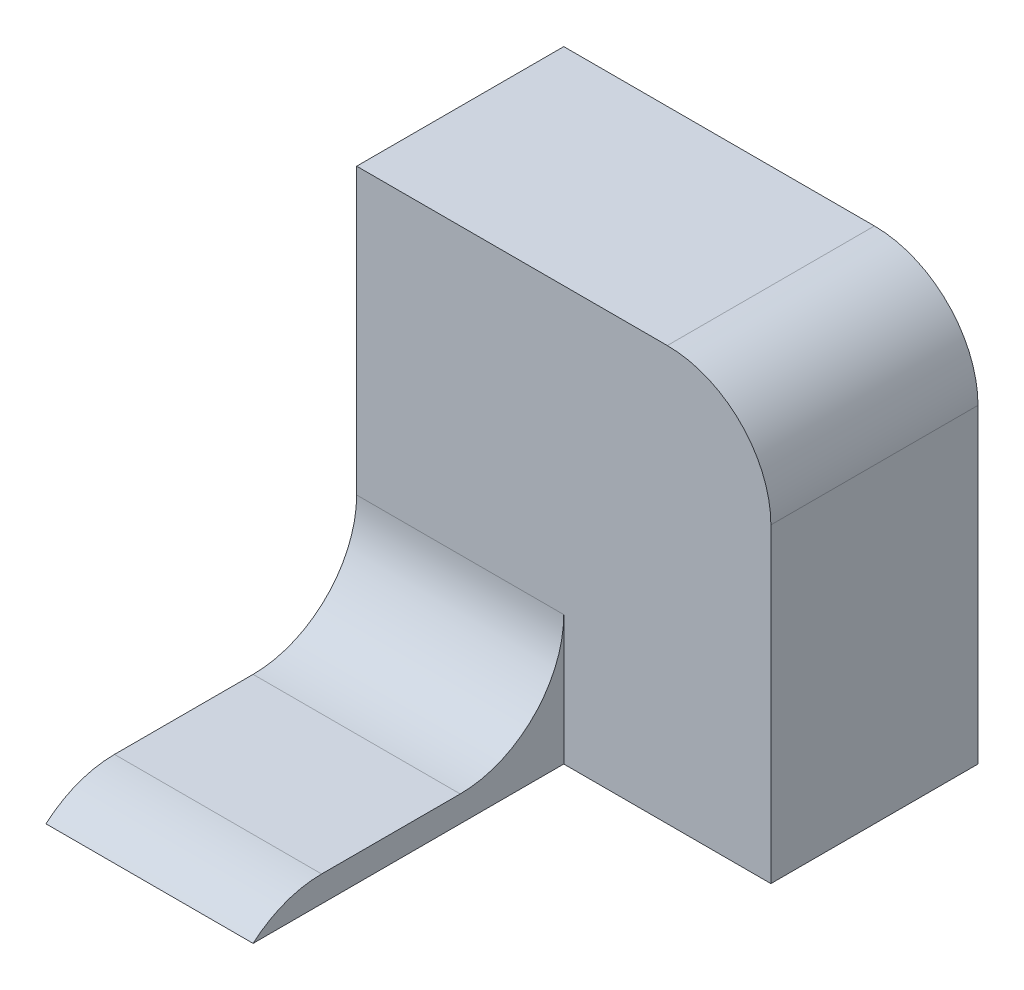
ISO-10303-21;
HEADER;
FILE_DESCRIPTION(('STEP AP214'),'2;1');
FILE_NAME('part.step','',(''),(''),'','','');
FILE_SCHEMA(('AUTOMOTIVE_DESIGN { 1 0 10303 214 1 1 1 1 }'));
ENDSEC;
DATA;
#1=APPLICATION_CONTEXT('core data for automotive mechanical design processes');
#2=APPLICATION_PROTOCOL_DEFINITION('international standard','automotive_design',2000,#1);
#3=PRODUCT_CONTEXT('',#1,'mechanical');
#4=PRODUCT('Part','Part','',(#3));
#5=PRODUCT_RELATED_PRODUCT_CATEGORY('part','',(#4));
#6=PRODUCT_DEFINITION_FORMATION('','',#4);
#7=PRODUCT_DEFINITION_CONTEXT('part definition',#1,'design');
#8=PRODUCT_DEFINITION('design','',#6,#7);
#9=PRODUCT_DEFINITION_SHAPE('','',#8);
#10=(LENGTH_UNIT() NAMED_UNIT(*) SI_UNIT(.MILLI.,.METRE.));
#11=(NAMED_UNIT(*) PLANE_ANGLE_UNIT() SI_UNIT($,.RADIAN.));
#12=(NAMED_UNIT(*) SI_UNIT($,.STERADIAN.) SOLID_ANGLE_UNIT());
#13=UNCERTAINTY_MEASURE_WITH_UNIT(LENGTH_MEASURE(1.E-05),#10,'distance_accuracy_value','');
#14=(GEOMETRIC_REPRESENTATION_CONTEXT(3) GLOBAL_UNCERTAINTY_ASSIGNED_CONTEXT((#13)) GLOBAL_UNIT_ASSIGNED_CONTEXT((#10,
#11,#12)) REPRESENTATION_CONTEXT('',''));
#15=CARTESIAN_POINT('',(0.,0.,0.));
#16=DIRECTION('',(0.,0.,1.));
#17=DIRECTION('',(1.,0.,0.));
#18=AXIS2_PLACEMENT_3D('',#15,#16,#17);
#19=CARTESIAN_POINT('',(-10.,0.,30.));
#20=DIRECTION('',(0.,-1.,0.));
#21=DIRECTION('',(1.,0.,0.));
#22=AXIS2_PLACEMENT_3D('',#19,#20,#21);
#23=PLANE('',#22);
#24=DIRECTION('',(0.,0.,-1.));
#25=VECTOR('',#24,1.);
#26=CARTESIAN_POINT('',(-10.,0.,30.));
#27=LINE('',#26,#25);
#28=CARTESIAN_POINT('',(-10.,0.,23.3856217223385));
#29=VERTEX_POINT('',#28);
#30=CARTESIAN_POINT('',(-10.,0.,10.));
#31=VERTEX_POINT('',#30);
#32=EDGE_CURVE('E144',#29,#31,#27,.T.);
#33=ORIENTED_EDGE('',*,*,#32,.T.);
#34=DIRECTION('',(-1.,0.,0.));
#35=VECTOR('',#34,1.);
#36=CARTESIAN_POINT('',(-10.,0.,10.));
#37=LINE('',#36,#35);
#38=CARTESIAN_POINT('',(-30.,0.,10.));
#39=VERTEX_POINT('',#38);
#40=EDGE_CURVE('E158',#31,#39,#37,.T.);
#41=ORIENTED_EDGE('',*,*,#40,.T.);
#42=DIRECTION('',(0.,0.,-1.));
#43=VECTOR('',#42,1.);
#44=CARTESIAN_POINT('',(-30.,0.,30.));
#45=LINE('',#44,#43);
#46=CARTESIAN_POINT('',(-30.,0.,23.3856217223385));
#47=VERTEX_POINT('',#46);
#48=EDGE_CURVE('E153',#47,#39,#45,.T.);
#49=ORIENTED_EDGE('',*,*,#48,.F.);
#50=DIRECTION('',(-1.,0.,0.));
#51=VECTOR('',#50,1.);
#52=CARTESIAN_POINT('',(-10.,0.,23.3856217223385));
#53=LINE('',#52,#51);
#54=EDGE_CURVE('E156',#47,#29,#53,.F.);
#55=ORIENTED_EDGE('',*,*,#54,.T.);
#56=EDGE_LOOP('',(#33,#41,#49,#55));
#57=FACE_BOUND('',#56,.T.);
#58=ADVANCED_FACE('F35',(#57),#23,.F.);
#59=CARTESIAN_POINT('',(-30.,0.,30.));
#60=DIRECTION('',(1.,0.,0.));
#61=DIRECTION('',(0.,0.,-1.));
#62=AXIS2_PLACEMENT_3D('',#59,#60,#61);
#63=PLANE('',#62);
#64=DIRECTION('',(0.,0.,-1.));
#65=VECTOR('',#64,1.);
#66=CARTESIAN_POINT('',(-30.,-2.5,30.));
#67=LINE('',#66,#65);
#68=CARTESIAN_POINT('',(-30.,-2.5,30.));
#69=VERTEX_POINT('',#68);
#70=CARTESIAN_POINT('',(-30.,-2.5,-20.));
#71=VERTEX_POINT('',#70);
#72=EDGE_CURVE('E151',#69,#71,#67,.T.);
#73=ORIENTED_EDGE('',*,*,#72,.F.);
#74=CARTESIAN_POINT('',(-30.,-10.,23.3856217223385));
#75=DIRECTION('',(1.,0.,0.));
#76=DIRECTION('',(0.,0.,-1.));
#77=AXIS2_PLACEMENT_3D('',#74,#75,#76);
#78=CIRCLE('',#77,10.);
#79=EDGE_CURVE('E171',#69,#47,#78,.F.);
#80=ORIENTED_EDGE('',*,*,#79,.T.);
#81=ORIENTED_EDGE('',*,*,#48,.T.);
#82=CARTESIAN_POINT('',(-30.,10.,10.));
#83=DIRECTION('',(1.,0.,0.));
#84=DIRECTION('',(0.,0.,-1.));
#85=AXIS2_PLACEMENT_3D('',#82,#83,#84);
#86=CIRCLE('',#85,10.);
#87=CARTESIAN_POINT('',(-30.,10.,0.));
#88=VERTEX_POINT('',#87);
#89=EDGE_CURVE('E43',#39,#88,#86,.T.);
#90=ORIENTED_EDGE('',*,*,#89,.T.);
#91=DIRECTION('',(0.,-1.,0.));
#92=VECTOR('',#91,1.);
#93=CARTESIAN_POINT('',(-30.,37.5,0.));
#94=LINE('',#93,#92);
#95=CARTESIAN_POINT('',(-30.,37.5,0.));
#96=VERTEX_POINT('',#95);
#97=EDGE_CURVE('E119',#96,#88,#94,.T.);
#98=ORIENTED_EDGE('',*,*,#97,.F.);
#99=DIRECTION('',(0.,0.,1.));
#100=VECTOR('',#99,1.);
#101=CARTESIAN_POINT('',(-30.,37.5,-20.));
#102=LINE('',#101,#100);
#103=CARTESIAN_POINT('',(-30.,37.5,-20.));
#104=VERTEX_POINT('',#103);
#105=EDGE_CURVE('E108',#104,#96,#102,.T.);
#106=ORIENTED_EDGE('',*,*,#105,.F.);
#107=DIRECTION('',(0.,-1.,0.));
#108=VECTOR('',#107,1.);
#109=CARTESIAN_POINT('',(-30.,37.5,-20.));
#110=LINE('',#109,#108);
#111=EDGE_CURVE('E111',#104,#71,#110,.T.);
#112=ORIENTED_EDGE('',*,*,#111,.T.);
#113=EDGE_LOOP('',(#73,#80,#81,#90,#98,#106,#112));
#114=FACE_BOUND('',#113,.T.);
#115=ADVANCED_FACE('F117',(#114),#63,.F.);
#116=CARTESIAN_POINT('',(-30.,-2.5,30.));
#117=DIRECTION('',(0.,1.,0.));
#118=DIRECTION('',(0.,0.,1.));
#119=AXIS2_PLACEMENT_3D('',#116,#117,#118);
#120=PLANE('',#119);
#121=ORIENTED_EDGE('',*,*,#72,.T.);
#122=DIRECTION('',(1.,0.,0.));
#123=VECTOR('',#122,1.);
#124=CARTESIAN_POINT('',(-30.,-2.5,-20.));
#125=LINE('',#124,#123);
#126=CARTESIAN_POINT('',(10.,-2.5,-20.));
#127=VERTEX_POINT('',#126);
#128=EDGE_CURVE('E126',#71,#127,#125,.T.);
#129=ORIENTED_EDGE('',*,*,#128,.T.);
#130=DIRECTION('',(0.,0.,1.));
#131=VECTOR('',#130,1.);
#132=CARTESIAN_POINT('',(10.,-2.5,-20.));
#133=LINE('',#132,#131);
#134=CARTESIAN_POINT('',(10.,-2.5,0.));
#135=VERTEX_POINT('',#134);
#136=EDGE_CURVE('E120',#127,#135,#133,.T.);
#137=ORIENTED_EDGE('',*,*,#136,.T.);
#138=DIRECTION('',(1.,0.,0.));
#139=VECTOR('',#138,1.);
#140=CARTESIAN_POINT('',(-30.,-2.5,0.));
#141=LINE('',#140,#139);
#142=CARTESIAN_POINT('',(-10.,-2.5,0.));
#143=VERTEX_POINT('',#142);
#144=EDGE_CURVE('E134',#143,#135,#141,.T.);
#145=ORIENTED_EDGE('',*,*,#144,.F.);
#146=DIRECTION('',(0.,0.,-1.));
#147=VECTOR('',#146,1.);
#148=CARTESIAN_POINT('',(-10.,-2.5,30.));
#149=LINE('',#148,#147);
#150=CARTESIAN_POINT('',(-10.,-2.5,30.));
#151=VERTEX_POINT('',#150);
#152=EDGE_CURVE('E148',#151,#143,#149,.T.);
#153=ORIENTED_EDGE('',*,*,#152,.F.);
#154=DIRECTION('',(1.,0.,0.));
#155=VECTOR('',#154,1.);
#156=CARTESIAN_POINT('',(-30.,-2.5,30.));
#157=LINE('',#156,#155);
#158=EDGE_CURVE('E141',#69,#151,#157,.T.);
#159=ORIENTED_EDGE('',*,*,#158,.F.);
#160=EDGE_LOOP('',(#121,#129,#137,#145,#153,#159));
#161=FACE_BOUND('',#160,.T.);
#162=ADVANCED_FACE('F193',(#161),#120,.F.);
#163=CARTESIAN_POINT('',(-10.,-2.5,30.));
#164=DIRECTION('',(-1.,0.,0.));
#165=DIRECTION('',(0.,0.,1.));
#166=AXIS2_PLACEMENT_3D('',#163,#164,#165);
#167=PLANE('',#166);
#168=ORIENTED_EDGE('',*,*,#32,.F.);
#169=CARTESIAN_POINT('',(-10.,-10.,23.3856217223385));
#170=DIRECTION('',(-1.,0.,0.));
#171=DIRECTION('',(0.,0.,1.));
#172=AXIS2_PLACEMENT_3D('',#169,#170,#171);
#173=CIRCLE('',#172,10.);
#174=EDGE_CURVE('E173',#29,#151,#173,.F.);
#175=ORIENTED_EDGE('',*,*,#174,.T.);
#176=ORIENTED_EDGE('',*,*,#152,.T.);
#177=DIRECTION('',(0.,1.,0.));
#178=VECTOR('',#177,1.);
#179=CARTESIAN_POINT('',(-10.,-2.5,0.));
#180=LINE('',#179,#178);
#181=CARTESIAN_POINT('',(-10.,10.,0.));
#182=VERTEX_POINT('',#181);
#183=EDGE_CURVE('E139',#143,#182,#180,.T.);
#184=ORIENTED_EDGE('',*,*,#183,.T.);
#185=CARTESIAN_POINT('',(-10.,10.,10.));
#186=DIRECTION('',(-1.,0.,0.));
#187=DIRECTION('',(0.,0.,1.));
#188=AXIS2_PLACEMENT_3D('',#185,#186,#187);
#189=CIRCLE('',#188,10.);
#190=EDGE_CURVE('E11',#182,#31,#189,.T.);
#191=ORIENTED_EDGE('',*,*,#190,.T.);
#192=EDGE_LOOP('',(#168,#175,#176,#184,#191));
#193=FACE_BOUND('',#192,.T.);
#194=ADVANCED_FACE('F184',(#193),#167,.F.);
#195=CARTESIAN_POINT('',(0.,0.,0.));
#196=DIRECTION('',(0.,0.,1.));
#197=DIRECTION('',(1.,0.,0.));
#198=AXIS2_PLACEMENT_3D('',#195,#196,#197);
#199=PLANE('',#198);
#200=ORIENTED_EDGE('',*,*,#97,.T.);
#201=DIRECTION('',(-1.,0.,0.));
#202=VECTOR('',#201,1.);
#203=CARTESIAN_POINT('',(0.,10.,0.));
#204=LINE('',#203,#202);
#205=EDGE_CURVE('E163',#88,#182,#204,.F.);
#206=ORIENTED_EDGE('',*,*,#205,.T.);
#207=ORIENTED_EDGE('',*,*,#183,.F.);
#208=ORIENTED_EDGE('',*,*,#144,.T.);
#209=DIRECTION('',(0.,1.,0.));
#210=VECTOR('',#209,1.);
#211=CARTESIAN_POINT('',(10.,-2.5,0.));
#212=LINE('',#211,#210);
#213=CARTESIAN_POINT('',(10.,27.5,0.));
#214=VERTEX_POINT('',#213);
#215=EDGE_CURVE('E112',#135,#214,#212,.T.);
#216=ORIENTED_EDGE('',*,*,#215,.T.);
#217=CARTESIAN_POINT('',(0.,27.5,0.));
#218=DIRECTION('',(0.,0.,1.));
#219=DIRECTION('',(1.,0.,0.));
#220=AXIS2_PLACEMENT_3D('',#217,#218,#219);
#221=CIRCLE('',#220,10.);
#222=CARTESIAN_POINT('',(0.,37.5,0.));
#223=VERTEX_POINT('',#222);
#224=EDGE_CURVE('E161',#214,#223,#221,.T.);
#225=ORIENTED_EDGE('',*,*,#224,.T.);
#226=DIRECTION('',(-1.,0.,0.));
#227=VECTOR('',#226,1.);
#228=CARTESIAN_POINT('',(10.,37.5,0.));
#229=LINE('',#228,#227);
#230=EDGE_CURVE('E131',#223,#96,#229,.T.);
#231=ORIENTED_EDGE('',*,*,#230,.T.);
#232=EDGE_LOOP('',(#200,#206,#207,#208,#216,#225,#231));
#233=FACE_BOUND('',#232,.T.);
#234=ADVANCED_FACE('F179',(#233),#199,.T.);
#235=CARTESIAN_POINT('',(10.,37.5,-20.));
#236=DIRECTION('',(0.,1.,0.));
#237=DIRECTION('',(-1.,0.,0.));
#238=AXIS2_PLACEMENT_3D('',#235,#236,#237);
#239=PLANE('',#238);
#240=ORIENTED_EDGE('',*,*,#230,.F.);
#241=DIRECTION('',(0.,0.,1.));
#242=VECTOR('',#241,1.);
#243=CARTESIAN_POINT('',(0.,37.5,-20.));
#244=LINE('',#243,#242);
#245=CARTESIAN_POINT('',(0.,37.5,-20.));
#246=VERTEX_POINT('',#245);
#247=EDGE_CURVE('E50',#223,#246,#244,.F.);
#248=ORIENTED_EDGE('',*,*,#247,.T.);
#249=DIRECTION('',(-1.,0.,0.));
#250=VECTOR('',#249,1.);
#251=CARTESIAN_POINT('',(10.,37.5,-20.));
#252=LINE('',#251,#250);
#253=EDGE_CURVE('E105',#246,#104,#252,.T.);
#254=ORIENTED_EDGE('',*,*,#253,.T.);
#255=ORIENTED_EDGE('',*,*,#105,.T.);
#256=EDGE_LOOP('',(#240,#248,#254,#255));
#257=FACE_BOUND('',#256,.T.);
#258=ADVANCED_FACE('F107',(#257),#239,.T.);
#259=CARTESIAN_POINT('',(10.,-2.5,-20.));
#260=DIRECTION('',(1.,0.,0.));
#261=DIRECTION('',(0.,0.,-1.));
#262=AXIS2_PLACEMENT_3D('',#259,#260,#261);
#263=PLANE('',#262);
#264=DIRECTION('',(0.,1.,0.));
#265=VECTOR('',#264,1.);
#266=CARTESIAN_POINT('',(10.,-2.5,-20.));
#267=LINE('',#266,#265);
#268=CARTESIAN_POINT('',(10.,27.5,-20.));
#269=VERTEX_POINT('',#268);
#270=EDGE_CURVE('E121',#127,#269,#267,.T.);
#271=ORIENTED_EDGE('',*,*,#270,.T.);
#272=DIRECTION('',(0.,0.,1.));
#273=VECTOR('',#272,1.);
#274=CARTESIAN_POINT('',(10.,27.5,-20.));
#275=LINE('',#274,#273);
#276=EDGE_CURVE('E166',#269,#214,#275,.T.);
#277=ORIENTED_EDGE('',*,*,#276,.T.);
#278=ORIENTED_EDGE('',*,*,#215,.F.);
#279=ORIENTED_EDGE('',*,*,#136,.F.);
#280=EDGE_LOOP('',(#271,#277,#278,#279));
#281=FACE_BOUND('',#280,.T.);
#282=ADVANCED_FACE('F196',(#281),#263,.T.);
#283=CARTESIAN_POINT('',(0.,0.,-20.));
#284=DIRECTION('',(0.,0.,1.));
#285=DIRECTION('',(1.,0.,0.));
#286=AXIS2_PLACEMENT_3D('',#283,#284,#285);
#287=PLANE('',#286);
#288=ORIENTED_EDGE('',*,*,#253,.F.);
#289=CARTESIAN_POINT('',(0.,27.5,-20.));
#290=DIRECTION('',(0.,0.,1.));
#291=DIRECTION('',(1.,0.,0.));
#292=AXIS2_PLACEMENT_3D('',#289,#290,#291);
#293=CIRCLE('',#292,10.);
#294=EDGE_CURVE('E57',#246,#269,#293,.F.);
#295=ORIENTED_EDGE('',*,*,#294,.T.);
#296=ORIENTED_EDGE('',*,*,#270,.F.);
#297=ORIENTED_EDGE('',*,*,#128,.F.);
#298=ORIENTED_EDGE('',*,*,#111,.F.);
#299=EDGE_LOOP('',(#288,#295,#296,#297,#298));
#300=FACE_BOUND('',#299,.T.);
#301=ADVANCED_FACE('F124',(#300),#287,.F.);
#302=CARTESIAN_POINT('',(-10.,10.,10.));
#303=DIRECTION('',(-1.,0.,0.));
#304=DIRECTION('',(0.,-1.,0.));
#305=AXIS2_PLACEMENT_3D('',#302,#303,#304);
#306=CYLINDRICAL_SURFACE('',#305,10.);
#307=ORIENTED_EDGE('',*,*,#190,.F.);
#308=ORIENTED_EDGE('',*,*,#205,.F.);
#309=ORIENTED_EDGE('',*,*,#89,.F.);
#310=ORIENTED_EDGE('',*,*,#40,.F.);
#311=EDGE_LOOP('',(#307,#308,#309,#310));
#312=FACE_BOUND('',#311,.T.);
#313=ADVANCED_FACE('F181',(#312),#306,.F.);
#314=CARTESIAN_POINT('',(0.,27.5,-20.));
#315=DIRECTION('',(0.,0.,1.));
#316=DIRECTION('',(1.,0.,0.));
#317=AXIS2_PLACEMENT_3D('',#314,#315,#316);
#318=CYLINDRICAL_SURFACE('',#317,10.);
#319=ORIENTED_EDGE('',*,*,#294,.F.);
#320=ORIENTED_EDGE('',*,*,#247,.F.);
#321=ORIENTED_EDGE('',*,*,#224,.F.);
#322=ORIENTED_EDGE('',*,*,#276,.F.);
#323=EDGE_LOOP('',(#319,#320,#321,#322));
#324=FACE_BOUND('',#323,.T.);
#325=ADVANCED_FACE('F199',(#324),#318,.T.);
#326=CARTESIAN_POINT('',(0.,-10.,23.3856217223385));
#327=DIRECTION('',(-1.,0.,0.));
#328=DIRECTION('',(0.,0.,1.));
#329=AXIS2_PLACEMENT_3D('',#326,#327,#328);
#330=CYLINDRICAL_SURFACE('',#329,10.);
#331=ORIENTED_EDGE('',*,*,#174,.F.);
#332=ORIENTED_EDGE('',*,*,#54,.F.);
#333=ORIENTED_EDGE('',*,*,#79,.F.);
#334=ORIENTED_EDGE('',*,*,#158,.T.);
#335=EDGE_LOOP('',(#331,#332,#333,#334));
#336=FACE_BOUND('',#335,.T.);
#337=ADVANCED_FACE('F37',(#336),#330,.T.);
#338=CLOSED_SHELL('',(#58,#115,#162,#194,#234,#258,#282,#301,#313,#325,#337));
#339=MANIFOLD_SOLID_BREP('B2',#338);
#340=ADVANCED_BREP_SHAPE_REPRESENTATION('',(#18,#339),#14);
#341=SHAPE_DEFINITION_REPRESENTATION(#9,#340);
ENDSEC;
END-ISO-10303-21;
